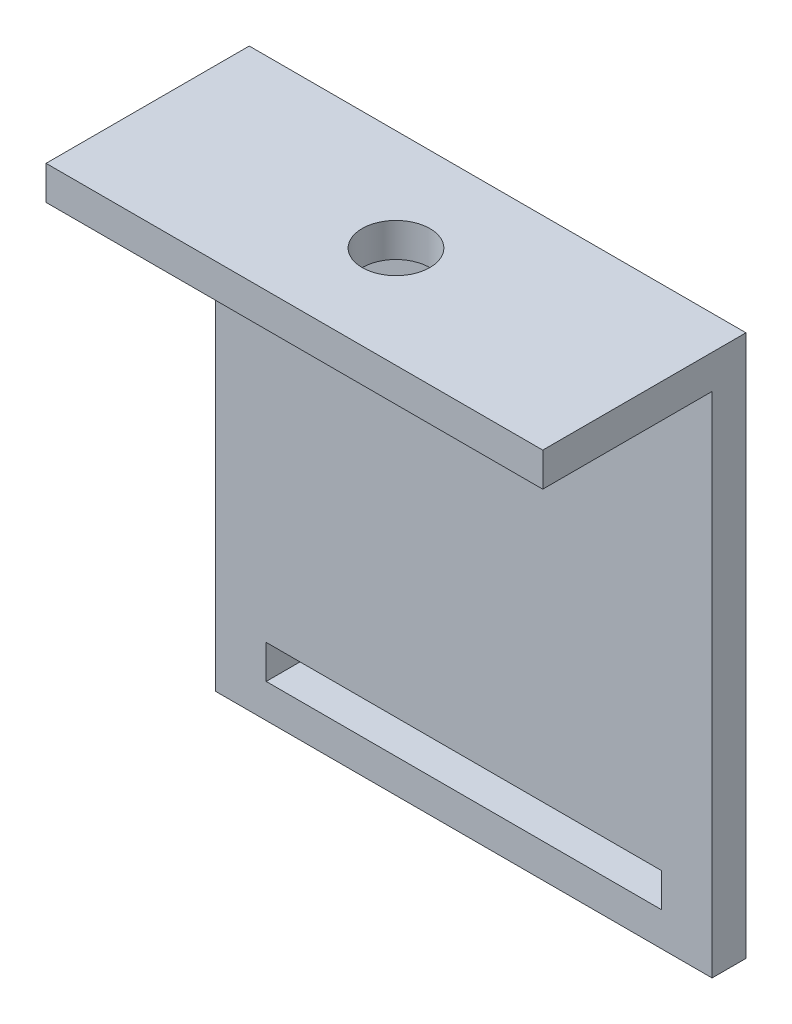
ISO-10303-21;
HEADER;
FILE_DESCRIPTION(('STEP AP214'),'2;1');
FILE_NAME('part.step','',(''),(''),'','','');
FILE_SCHEMA(('AUTOMOTIVE_DESIGN { 1 0 10303 214 1 1 1 1 }'));
ENDSEC;
DATA;
#1=APPLICATION_CONTEXT('core data for automotive mechanical design processes');
#2=APPLICATION_PROTOCOL_DEFINITION('international standard','automotive_design',2000,#1);
#3=PRODUCT_CONTEXT('',#1,'mechanical');
#4=PRODUCT('Part','Part','',(#3));
#5=PRODUCT_RELATED_PRODUCT_CATEGORY('part','',(#4));
#6=PRODUCT_DEFINITION_FORMATION('','',#4);
#7=PRODUCT_DEFINITION_CONTEXT('part definition',#1,'design');
#8=PRODUCT_DEFINITION('design','',#6,#7);
#9=PRODUCT_DEFINITION_SHAPE('','',#8);
#10=(LENGTH_UNIT() NAMED_UNIT(*) SI_UNIT(.MILLI.,.METRE.));
#11=(NAMED_UNIT(*) PLANE_ANGLE_UNIT() SI_UNIT($,.RADIAN.));
#12=(NAMED_UNIT(*) SI_UNIT($,.STERADIAN.) SOLID_ANGLE_UNIT());
#13=UNCERTAINTY_MEASURE_WITH_UNIT(LENGTH_MEASURE(1.E-05),#10,'distance_accuracy_value','');
#14=(GEOMETRIC_REPRESENTATION_CONTEXT(3) GLOBAL_UNCERTAINTY_ASSIGNED_CONTEXT((#13)) GLOBAL_UNIT_ASSIGNED_CONTEXT((#10,
#11,#12)) REPRESENTATION_CONTEXT('',''));
#15=CARTESIAN_POINT('',(0.,0.,0.));
#16=DIRECTION('',(0.,0.,1.));
#17=DIRECTION('',(1.,0.,0.));
#18=AXIS2_PLACEMENT_3D('',#15,#16,#17);
#19=CARTESIAN_POINT('',(44.,0.,-15.));
#20=DIRECTION('',(0.,1.,0.));
#21=DIRECTION('',(0.,0.,1.));
#22=AXIS2_PLACEMENT_3D('',#19,#20,#21);
#23=PLANE('',#22);
#24=CARTESIAN_POINT('',(22.,0.,-9.));
#25=DIRECTION('',(0.,1.,0.));
#26=DIRECTION('',(0.,0.,1.));
#27=AXIS2_PLACEMENT_3D('',#24,#25,#26);
#28=CIRCLE('',#27,3.);
#29=CARTESIAN_POINT('',(22.,0.,-6.));
#30=VERTEX_POINT('',#29);
#31=EDGE_CURVE('E213',#30,#30,#28,.T.);
#32=ORIENTED_EDGE('',*,*,#31,.T.);
#33=EDGE_LOOP('',(#32));
#34=FACE_BOUND('',#33,.T.);
#35=DIRECTION('',(0.,0.,-1.));
#36=VECTOR('',#35,1.);
#37=CARTESIAN_POINT('',(0.,0.,-15.));
#38=LINE('',#37,#36);
#39=CARTESIAN_POINT('',(0.,0.,0.));
#40=VERTEX_POINT('',#39);
#41=CARTESIAN_POINT('',(0.,0.,-15.));
#42=VERTEX_POINT('',#41);
#43=EDGE_CURVE('E135',#40,#42,#38,.T.);
#44=ORIENTED_EDGE('',*,*,#43,.T.);
#45=DIRECTION('',(-1.,0.,0.));
#46=VECTOR('',#45,1.);
#47=CARTESIAN_POINT('',(44.,0.,-15.));
#48=LINE('',#47,#46);
#49=CARTESIAN_POINT('',(44.,0.,-15.));
#50=VERTEX_POINT('',#49);
#51=EDGE_CURVE('E178',#50,#42,#48,.T.);
#52=ORIENTED_EDGE('',*,*,#51,.F.);
#53=DIRECTION('',(0.,0.,-1.));
#54=VECTOR('',#53,1.);
#55=CARTESIAN_POINT('',(44.,0.,-15.));
#56=LINE('',#55,#54);
#57=CARTESIAN_POINT('',(44.,0.,0.));
#58=VERTEX_POINT('',#57);
#59=EDGE_CURVE('E138',#58,#50,#56,.T.);
#60=ORIENTED_EDGE('',*,*,#59,.F.);
#61=DIRECTION('',(-1.,0.,0.));
#62=VECTOR('',#61,1.);
#63=CARTESIAN_POINT('',(44.,0.,0.));
#64=LINE('',#63,#62);
#65=EDGE_CURVE('E152',#58,#40,#64,.T.);
#66=ORIENTED_EDGE('',*,*,#65,.T.);
#67=EDGE_LOOP('',(#44,#52,#60,#66));
#68=FACE_BOUND('',#67,.T.);
#69=ADVANCED_FACE('F33',(#34,#68),#23,.F.);
#70=CARTESIAN_POINT('',(44.,-45.,-15.));
#71=DIRECTION('',(0.,0.,-1.));
#72=DIRECTION('',(0.,1.,0.));
#73=AXIS2_PLACEMENT_3D('',#70,#71,#72);
#74=PLANE('',#73);
#75=DIRECTION('',(1.,0.,0.));
#76=VECTOR('',#75,1.);
#77=CARTESIAN_POINT('',(4.5,-42.,-15.));
#78=LINE('',#77,#76);
#79=CARTESIAN_POINT('',(4.5,-42.,-15.));
#80=VERTEX_POINT('',#79);
#81=CARTESIAN_POINT('',(39.5,-42.,-15.));
#82=VERTEX_POINT('',#81);
#83=EDGE_CURVE('E121',#80,#82,#78,.T.);
#84=ORIENTED_EDGE('',*,*,#83,.F.);
#85=DIRECTION('',(0.,-1.,0.));
#86=VECTOR('',#85,1.);
#87=CARTESIAN_POINT('',(4.5,-42.,-15.));
#88=LINE('',#87,#86);
#89=CARTESIAN_POINT('',(4.5,-39.,-15.));
#90=VERTEX_POINT('',#89);
#91=EDGE_CURVE('E47',#90,#80,#88,.T.);
#92=ORIENTED_EDGE('',*,*,#91,.F.);
#93=DIRECTION('',(-1.,0.,0.));
#94=VECTOR('',#93,1.);
#95=CARTESIAN_POINT('',(4.5,-39.,-15.));
#96=LINE('',#95,#94);
#97=CARTESIAN_POINT('',(39.5,-39.,-15.));
#98=VERTEX_POINT('',#97);
#99=EDGE_CURVE('E128',#98,#90,#96,.T.);
#100=ORIENTED_EDGE('',*,*,#99,.F.);
#101=DIRECTION('',(0.,1.,0.));
#102=VECTOR('',#101,1.);
#103=CARTESIAN_POINT('',(39.5,-42.,-15.));
#104=LINE('',#103,#102);
#105=EDGE_CURVE('E112',#82,#98,#104,.T.);
#106=ORIENTED_EDGE('',*,*,#105,.F.);
#107=EDGE_LOOP('',(#84,#92,#100,#106));
#108=FACE_BOUND('',#107,.T.);
#109=DIRECTION('',(0.,-1.,0.));
#110=VECTOR('',#109,1.);
#111=CARTESIAN_POINT('',(0.,-45.,-15.));
#112=LINE('',#111,#110);
#113=CARTESIAN_POINT('',(0.,-45.,-15.));
#114=VERTEX_POINT('',#113);
#115=EDGE_CURVE('E155',#42,#114,#112,.T.);
#116=ORIENTED_EDGE('',*,*,#115,.T.);
#117=DIRECTION('',(-1.,0.,0.));
#118=VECTOR('',#117,1.);
#119=CARTESIAN_POINT('',(44.,-45.,-15.));
#120=LINE('',#119,#118);
#121=CARTESIAN_POINT('',(44.,-45.,-15.));
#122=VERTEX_POINT('',#121);
#123=EDGE_CURVE('E175',#122,#114,#120,.T.);
#124=ORIENTED_EDGE('',*,*,#123,.F.);
#125=DIRECTION('',(0.,-1.,0.));
#126=VECTOR('',#125,1.);
#127=CARTESIAN_POINT('',(44.,-45.,-15.));
#128=LINE('',#127,#126);
#129=EDGE_CURVE('E141',#50,#122,#128,.T.);
#130=ORIENTED_EDGE('',*,*,#129,.F.);
#131=ORIENTED_EDGE('',*,*,#51,.T.);
#132=EDGE_LOOP('',(#116,#124,#130,#131));
#133=FACE_BOUND('',#132,.T.);
#134=ADVANCED_FACE('F125',(#108,#133),#74,.F.);
#135=CARTESIAN_POINT('',(44.,-45.,-18.));
#136=DIRECTION('',(0.,1.,0.));
#137=DIRECTION('',(0.,0.,1.));
#138=AXIS2_PLACEMENT_3D('',#135,#136,#137);
#139=PLANE('',#138);
#140=DIRECTION('',(0.,0.,-1.));
#141=VECTOR('',#140,1.);
#142=CARTESIAN_POINT('',(0.,-45.,-18.));
#143=LINE('',#142,#141);
#144=CARTESIAN_POINT('',(0.,-45.,-18.));
#145=VERTEX_POINT('',#144);
#146=EDGE_CURVE('E157',#114,#145,#143,.T.);
#147=ORIENTED_EDGE('',*,*,#146,.T.);
#148=DIRECTION('',(-1.,0.,0.));
#149=VECTOR('',#148,1.);
#150=CARTESIAN_POINT('',(44.,-45.,-18.));
#151=LINE('',#150,#149);
#152=CARTESIAN_POINT('',(44.,-45.,-18.));
#153=VERTEX_POINT('',#152);
#154=EDGE_CURVE('E172',#153,#145,#151,.T.);
#155=ORIENTED_EDGE('',*,*,#154,.F.);
#156=DIRECTION('',(0.,0.,-1.));
#157=VECTOR('',#156,1.);
#158=CARTESIAN_POINT('',(44.,-45.,-18.));
#159=LINE('',#158,#157);
#160=EDGE_CURVE('E144',#122,#153,#159,.T.);
#161=ORIENTED_EDGE('',*,*,#160,.F.);
#162=ORIENTED_EDGE('',*,*,#123,.T.);
#163=EDGE_LOOP('',(#147,#155,#161,#162));
#164=FACE_BOUND('',#163,.T.);
#165=ADVANCED_FACE('F209',(#164),#139,.F.);
#166=CARTESIAN_POINT('',(44.,3.,-18.));
#167=DIRECTION('',(0.,0.,1.));
#168=DIRECTION('',(0.,-1.,0.));
#169=AXIS2_PLACEMENT_3D('',#166,#167,#168);
#170=PLANE('',#169);
#171=DIRECTION('',(-1.,0.,0.));
#172=VECTOR('',#171,1.);
#173=CARTESIAN_POINT('',(44.,-39.,-18.));
#174=LINE('',#173,#172);
#175=CARTESIAN_POINT('',(39.5,-39.,-18.));
#176=VERTEX_POINT('',#175);
#177=CARTESIAN_POINT('',(4.5,-39.,-18.));
#178=VERTEX_POINT('',#177);
#179=EDGE_CURVE('E40',#176,#178,#174,.T.);
#180=ORIENTED_EDGE('',*,*,#179,.T.);
#181=DIRECTION('',(0.,-1.,0.));
#182=VECTOR('',#181,1.);
#183=CARTESIAN_POINT('',(4.5,3.,-18.));
#184=LINE('',#183,#182);
#185=CARTESIAN_POINT('',(4.5,-42.,-18.));
#186=VERTEX_POINT('',#185);
#187=EDGE_CURVE('E11',#178,#186,#184,.T.);
#188=ORIENTED_EDGE('',*,*,#187,.T.);
#189=DIRECTION('',(1.,0.,0.));
#190=VECTOR('',#189,1.);
#191=CARTESIAN_POINT('',(44.,-42.,-18.));
#192=LINE('',#191,#190);
#193=CARTESIAN_POINT('',(39.5,-42.,-18.));
#194=VERTEX_POINT('',#193);
#195=EDGE_CURVE('E181',#186,#194,#192,.T.);
#196=ORIENTED_EDGE('',*,*,#195,.T.);
#197=DIRECTION('',(0.,1.,0.));
#198=VECTOR('',#197,1.);
#199=CARTESIAN_POINT('',(39.5,3.,-18.));
#200=LINE('',#199,#198);
#201=EDGE_CURVE('E115',#194,#176,#200,.T.);
#202=ORIENTED_EDGE('',*,*,#201,.T.);
#203=EDGE_LOOP('',(#180,#188,#196,#202));
#204=FACE_BOUND('',#203,.T.);
#205=DIRECTION('',(0.,1.,0.));
#206=VECTOR('',#205,1.);
#207=CARTESIAN_POINT('',(0.,3.,-18.));
#208=LINE('',#207,#206);
#209=CARTESIAN_POINT('',(0.,3.,-18.));
#210=VERTEX_POINT('',#209);
#211=EDGE_CURVE('E159',#145,#210,#208,.T.);
#212=ORIENTED_EDGE('',*,*,#211,.T.);
#213=DIRECTION('',(-1.,0.,0.));
#214=VECTOR('',#213,1.);
#215=CARTESIAN_POINT('',(44.,3.,-18.));
#216=LINE('',#215,#214);
#217=CARTESIAN_POINT('',(44.,3.,-18.));
#218=VERTEX_POINT('',#217);
#219=EDGE_CURVE('E169',#218,#210,#216,.T.);
#220=ORIENTED_EDGE('',*,*,#219,.F.);
#221=DIRECTION('',(0.,1.,0.));
#222=VECTOR('',#221,1.);
#223=CARTESIAN_POINT('',(44.,3.,-18.));
#224=LINE('',#223,#222);
#225=EDGE_CURVE('E146',#153,#218,#224,.T.);
#226=ORIENTED_EDGE('',*,*,#225,.F.);
#227=ORIENTED_EDGE('',*,*,#154,.T.);
#228=EDGE_LOOP('',(#212,#220,#226,#227));
#229=FACE_BOUND('',#228,.T.);
#230=ADVANCED_FACE('F185',(#204,#229),#170,.F.);
#231=CARTESIAN_POINT('',(44.,3.,0.));
#232=DIRECTION('',(0.,-1.,0.));
#233=DIRECTION('',(0.,0.,-1.));
#234=AXIS2_PLACEMENT_3D('',#231,#232,#233);
#235=PLANE('',#234);
#236=CARTESIAN_POINT('',(22.,3.,-9.));
#237=DIRECTION('',(0.,1.,0.));
#238=DIRECTION('',(0.,0.,1.));
#239=AXIS2_PLACEMENT_3D('',#236,#237,#238);
#240=CIRCLE('',#239,3.);
#241=CARTESIAN_POINT('',(22.,3.,-6.));
#242=VERTEX_POINT('',#241);
#243=EDGE_CURVE('E322',#242,#242,#240,.T.);
#244=ORIENTED_EDGE('',*,*,#243,.F.);
#245=EDGE_LOOP('',(#244));
#246=FACE_BOUND('',#245,.T.);
#247=DIRECTION('',(0.,0.,1.));
#248=VECTOR('',#247,1.);
#249=CARTESIAN_POINT('',(0.,3.,0.));
#250=LINE('',#249,#248);
#251=CARTESIAN_POINT('',(0.,3.,0.));
#252=VERTEX_POINT('',#251);
#253=EDGE_CURVE('E161',#210,#252,#250,.T.);
#254=ORIENTED_EDGE('',*,*,#253,.T.);
#255=DIRECTION('',(-1.,0.,0.));
#256=VECTOR('',#255,1.);
#257=CARTESIAN_POINT('',(44.,3.,0.));
#258=LINE('',#257,#256);
#259=CARTESIAN_POINT('',(44.,3.,0.));
#260=VERTEX_POINT('',#259);
#261=EDGE_CURVE('E166',#260,#252,#258,.T.);
#262=ORIENTED_EDGE('',*,*,#261,.F.);
#263=DIRECTION('',(0.,0.,1.));
#264=VECTOR('',#263,1.);
#265=CARTESIAN_POINT('',(44.,3.,0.));
#266=LINE('',#265,#264);
#267=EDGE_CURVE('E148',#218,#260,#266,.T.);
#268=ORIENTED_EDGE('',*,*,#267,.F.);
#269=ORIENTED_EDGE('',*,*,#219,.T.);
#270=EDGE_LOOP('',(#254,#262,#268,#269));
#271=FACE_BOUND('',#270,.T.);
#272=ADVANCED_FACE('F231',(#246,#271),#235,.F.);
#273=CARTESIAN_POINT('',(44.,0.,0.));
#274=DIRECTION('',(0.,0.,-1.));
#275=DIRECTION('',(-1.,0.,0.));
#276=AXIS2_PLACEMENT_3D('',#273,#274,#275);
#277=PLANE('',#276);
#278=DIRECTION('',(0.,-1.,0.));
#279=VECTOR('',#278,1.);
#280=CARTESIAN_POINT('',(0.,0.,0.));
#281=LINE('',#280,#279);
#282=EDGE_CURVE('E142',#252,#40,#281,.T.);
#283=ORIENTED_EDGE('',*,*,#282,.T.);
#284=ORIENTED_EDGE('',*,*,#65,.F.);
#285=DIRECTION('',(0.,-1.,0.));
#286=VECTOR('',#285,1.);
#287=CARTESIAN_POINT('',(44.,0.,0.));
#288=LINE('',#287,#286);
#289=EDGE_CURVE('E150',#260,#58,#288,.T.);
#290=ORIENTED_EDGE('',*,*,#289,.F.);
#291=ORIENTED_EDGE('',*,*,#261,.T.);
#292=EDGE_LOOP('',(#283,#284,#290,#291));
#293=FACE_BOUND('',#292,.T.);
#294=ADVANCED_FACE('F229',(#293),#277,.F.);
#295=CARTESIAN_POINT('',(44.,0.,0.));
#296=DIRECTION('',(-1.,0.,0.));
#297=DIRECTION('',(0.,0.,1.));
#298=AXIS2_PLACEMENT_3D('',#295,#296,#297);
#299=PLANE('',#298);
#300=ORIENTED_EDGE('',*,*,#59,.T.);
#301=ORIENTED_EDGE('',*,*,#129,.T.);
#302=ORIENTED_EDGE('',*,*,#160,.T.);
#303=ORIENTED_EDGE('',*,*,#225,.T.);
#304=ORIENTED_EDGE('',*,*,#267,.T.);
#305=ORIENTED_EDGE('',*,*,#289,.T.);
#306=EDGE_LOOP('',(#300,#301,#302,#303,#304,#305));
#307=FACE_BOUND('',#306,.T.);
#308=ADVANCED_FACE('F199',(#307),#299,.F.);
#309=CARTESIAN_POINT('',(0.,0.,0.));
#310=DIRECTION('',(-1.,0.,0.));
#311=DIRECTION('',(0.,0.,1.));
#312=AXIS2_PLACEMENT_3D('',#309,#310,#311);
#313=PLANE('',#312);
#314=ORIENTED_EDGE('',*,*,#43,.F.);
#315=ORIENTED_EDGE('',*,*,#282,.F.);
#316=ORIENTED_EDGE('',*,*,#253,.F.);
#317=ORIENTED_EDGE('',*,*,#211,.F.);
#318=ORIENTED_EDGE('',*,*,#146,.F.);
#319=ORIENTED_EDGE('',*,*,#115,.F.);
#320=EDGE_LOOP('',(#314,#315,#316,#317,#318,#319));
#321=FACE_BOUND('',#320,.T.);
#322=ADVANCED_FACE('F192',(#321),#313,.T.);
#323=CARTESIAN_POINT('',(4.5,-42.,-59.));
#324=DIRECTION('',(-1.,0.,0.));
#325=DIRECTION('',(0.,0.,1.));
#326=AXIS2_PLACEMENT_3D('',#323,#324,#325);
#327=PLANE('',#326);
#328=DIRECTION('',(0.,0.,1.));
#329=VECTOR('',#328,1.);
#330=CARTESIAN_POINT('',(4.5,-39.,-59.));
#331=LINE('',#330,#329);
#332=EDGE_CURVE('E133',#178,#90,#331,.T.);
#333=ORIENTED_EDGE('',*,*,#332,.T.);
#334=ORIENTED_EDGE('',*,*,#91,.T.);
#335=DIRECTION('',(0.,0.,1.));
#336=VECTOR('',#335,1.);
#337=CARTESIAN_POINT('',(4.5,-42.,-59.));
#338=LINE('',#337,#336);
#339=EDGE_CURVE('E118',#186,#80,#338,.T.);
#340=ORIENTED_EDGE('',*,*,#339,.F.);
#341=ORIENTED_EDGE('',*,*,#187,.F.);
#342=EDGE_LOOP('',(#333,#334,#340,#341));
#343=FACE_BOUND('',#342,.T.);
#344=ADVANCED_FACE('F190',(#343),#327,.F.);
#345=CARTESIAN_POINT('',(4.5,-39.,-59.));
#346=DIRECTION('',(0.,1.,0.));
#347=DIRECTION('',(0.,0.,1.));
#348=AXIS2_PLACEMENT_3D('',#345,#346,#347);
#349=PLANE('',#348);
#350=DIRECTION('',(0.,0.,1.));
#351=VECTOR('',#350,1.);
#352=CARTESIAN_POINT('',(39.5,-39.,-59.));
#353=LINE('',#352,#351);
#354=EDGE_CURVE('E117',#176,#98,#353,.T.);
#355=ORIENTED_EDGE('',*,*,#354,.T.);
#356=ORIENTED_EDGE('',*,*,#99,.T.);
#357=ORIENTED_EDGE('',*,*,#332,.F.);
#358=ORIENTED_EDGE('',*,*,#179,.F.);
#359=EDGE_LOOP('',(#355,#356,#357,#358));
#360=FACE_BOUND('',#359,.T.);
#361=ADVANCED_FACE('F189',(#360),#349,.F.);
#362=CARTESIAN_POINT('',(39.5,-42.,-59.));
#363=DIRECTION('',(1.,0.,0.));
#364=DIRECTION('',(0.,0.,-1.));
#365=AXIS2_PLACEMENT_3D('',#362,#363,#364);
#366=PLANE('',#365);
#367=DIRECTION('',(0.,0.,1.));
#368=VECTOR('',#367,1.);
#369=CARTESIAN_POINT('',(39.5,-42.,-59.));
#370=LINE('',#369,#368);
#371=EDGE_CURVE('E55',#194,#82,#370,.T.);
#372=ORIENTED_EDGE('',*,*,#371,.T.);
#373=ORIENTED_EDGE('',*,*,#105,.T.);
#374=ORIENTED_EDGE('',*,*,#354,.F.);
#375=ORIENTED_EDGE('',*,*,#201,.F.);
#376=EDGE_LOOP('',(#372,#373,#374,#375));
#377=FACE_BOUND('',#376,.T.);
#378=ADVANCED_FACE('F109',(#377),#366,.F.);
#379=CARTESIAN_POINT('',(4.5,-42.,-59.));
#380=DIRECTION('',(0.,-1.,0.));
#381=DIRECTION('',(0.,0.,-1.));
#382=AXIS2_PLACEMENT_3D('',#379,#380,#381);
#383=PLANE('',#382);
#384=ORIENTED_EDGE('',*,*,#339,.T.);
#385=ORIENTED_EDGE('',*,*,#83,.T.);
#386=ORIENTED_EDGE('',*,*,#371,.F.);
#387=ORIENTED_EDGE('',*,*,#195,.F.);
#388=EDGE_LOOP('',(#384,#385,#386,#387));
#389=FACE_BOUND('',#388,.T.);
#390=ADVANCED_FACE('F122',(#389),#383,.F.);
#391=CARTESIAN_POINT('',(22.,-7.,-9.));
#392=DIRECTION('',(0.,1.,0.));
#393=DIRECTION('',(0.,0.,1.));
#394=AXIS2_PLACEMENT_3D('',#391,#392,#393);
#395=CYLINDRICAL_SURFACE('',#394,3.);
#396=ORIENTED_EDGE('',*,*,#243,.T.);
#397=EDGE_LOOP('',(#396));
#398=FACE_BOUND('',#397,.T.);
#399=ORIENTED_EDGE('',*,*,#31,.F.);
#400=EDGE_LOOP('',(#399));
#401=FACE_BOUND('',#400,.T.);
#402=ADVANCED_FACE('F297',(#398,#401),#395,.F.);
#403=CLOSED_SHELL('',(#69,#134,#165,#230,#272,#294,#308,#322,#344,#361,#378,#390,#402));
#404=MANIFOLD_SOLID_BREP('B2',#403);
#405=ADVANCED_BREP_SHAPE_REPRESENTATION('',(#18,#404),#14);
#406=SHAPE_DEFINITION_REPRESENTATION(#9,#405);
ENDSEC;
END-ISO-10303-21;
